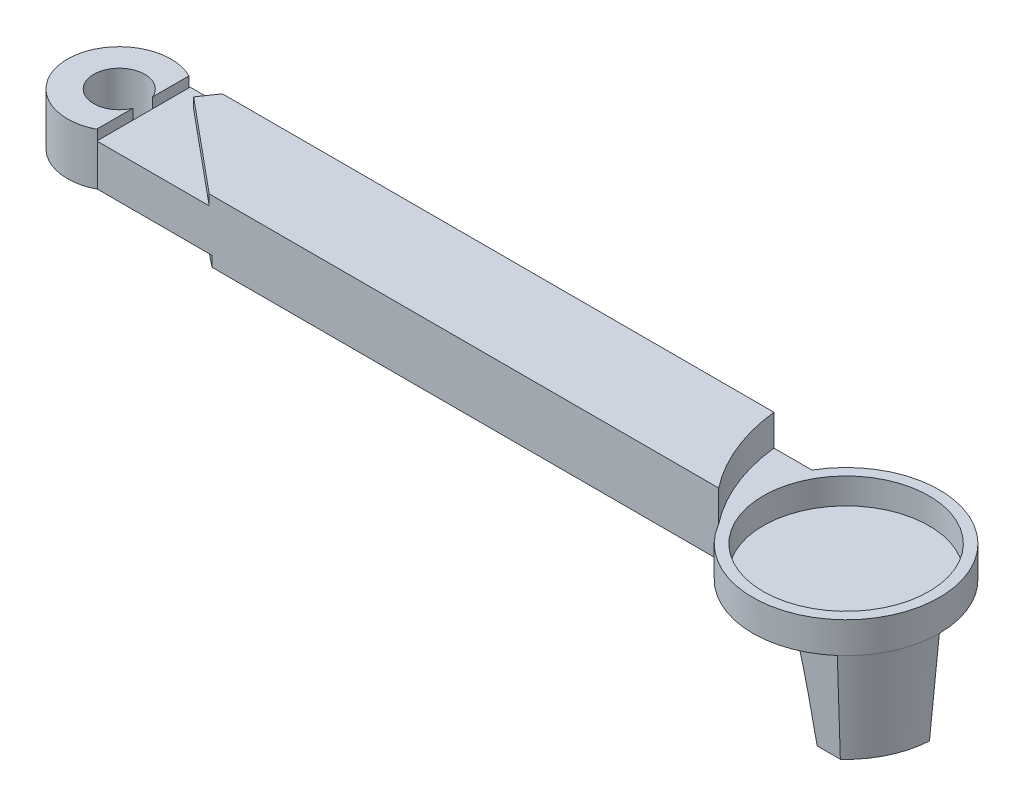
ISO-10303-21;
HEADER;
FILE_DESCRIPTION(('STEP AP214'),'2;1');
FILE_NAME('part.step','',(''),(''),'','','');
FILE_SCHEMA(('AUTOMOTIVE_DESIGN { 1 0 10303 214 1 1 1 1 }'));
ENDSEC;
DATA;
#1=APPLICATION_CONTEXT('core data for automotive mechanical design processes');
#2=APPLICATION_PROTOCOL_DEFINITION('international standard','automotive_design',2000,#1);
#3=PRODUCT_CONTEXT('',#1,'mechanical');
#4=PRODUCT('Part','Part','',(#3));
#5=PRODUCT_RELATED_PRODUCT_CATEGORY('part','',(#4));
#6=PRODUCT_DEFINITION_FORMATION('','',#4);
#7=PRODUCT_DEFINITION_CONTEXT('part definition',#1,'design');
#8=PRODUCT_DEFINITION('design','',#6,#7);
#9=PRODUCT_DEFINITION_SHAPE('','',#8);
#10=(LENGTH_UNIT() NAMED_UNIT(*) SI_UNIT(.MILLI.,.METRE.));
#11=(NAMED_UNIT(*) PLANE_ANGLE_UNIT() SI_UNIT($,.RADIAN.));
#12=(NAMED_UNIT(*) SI_UNIT($,.STERADIAN.) SOLID_ANGLE_UNIT());
#13=UNCERTAINTY_MEASURE_WITH_UNIT(LENGTH_MEASURE(1.E-05),#10,'distance_accuracy_value','');
#14=(GEOMETRIC_REPRESENTATION_CONTEXT(3) GLOBAL_UNCERTAINTY_ASSIGNED_CONTEXT((#13)) GLOBAL_UNIT_ASSIGNED_CONTEXT((#10,
#11,#12)) REPRESENTATION_CONTEXT('',''));
#15=CARTESIAN_POINT('',(0.,0.,0.));
#16=DIRECTION('',(0.,0.,1.));
#17=DIRECTION('',(1.,0.,0.));
#18=AXIS2_PLACEMENT_3D('',#15,#16,#17);
#19=CARTESIAN_POINT('',(0.,5.999999938,0.));
#20=DIRECTION('',(0.,0.,-1.));
#21=DIRECTION('',(-1.,0.,0.));
#22=AXIS2_PLACEMENT_3D('',#19,#20,#21);
#23=PLANE('',#22);
#24=DIRECTION('',(0.,1.,0.));
#25=VECTOR('',#24,1.);
#26=CARTESIAN_POINT('',(11.1059878060574,-116.582433247194,0.));
#27=LINE('',#26,#25);
#28=CARTESIAN_POINT('',(11.1059878060574,0.,0.));
#29=VERTEX_POINT('',#28);
#30=CARTESIAN_POINT('',(11.1059878060574,1.000000032,0.));
#31=VERTEX_POINT('',#30);
#32=EDGE_CURVE('E63',#29,#31,#27,.T.);
#33=ORIENTED_EDGE('',*,*,#32,.F.);
#34=DIRECTION('',(1.,0.,0.));
#35=VECTOR('',#34,1.);
#36=CARTESIAN_POINT('',(0.,0.,0.));
#37=LINE('',#36,#35);
#38=CARTESIAN_POINT('',(60.,0.,0.));
#39=VERTEX_POINT('',#38);
#40=EDGE_CURVE('E366',#29,#39,#37,.T.);
#41=ORIENTED_EDGE('',*,*,#40,.T.);
#42=DIRECTION('',(0.,-1.,0.));
#43=VECTOR('',#42,1.);
#44=CARTESIAN_POINT('',(60.,5.999999938,0.));
#45=LINE('',#44,#43);
#46=CARTESIAN_POINT('',(60.,2.999999938,0.));
#47=VERTEX_POINT('',#46);
#48=EDGE_CURVE('E51',#47,#39,#45,.T.);
#49=ORIENTED_EDGE('',*,*,#48,.F.);
#50=CARTESIAN_POINT('',(60.,5.999999938,0.));
#51=VERTEX_POINT('',#50);
#52=EDGE_CURVE('E11',#51,#47,#45,.T.);
#53=ORIENTED_EDGE('',*,*,#52,.F.);
#54=DIRECTION('',(1.,0.,0.));
#55=VECTOR('',#54,1.);
#56=CARTESIAN_POINT('',(0.,5.999999938,0.));
#57=LINE('',#56,#55);
#58=CARTESIAN_POINT('',(10.8365406297351,5.999999938,0.));
#59=VERTEX_POINT('',#58);
#60=EDGE_CURVE('E358',#59,#51,#57,.T.);
#61=ORIENTED_EDGE('',*,*,#60,.F.);
#62=DIRECTION('',(0.,1.,0.));
#63=VECTOR('',#62,1.);
#64=CARTESIAN_POINT('',(10.8365406297351,4.999999938,0.));
#65=LINE('',#64,#63);
#66=CARTESIAN_POINT('',(10.8365406297351,4.999999938,0.));
#67=VERTEX_POINT('',#66);
#68=EDGE_CURVE('E317',#67,#59,#65,.T.);
#69=ORIENTED_EDGE('',*,*,#68,.F.);
#70=DIRECTION('',(1.,0.,0.));
#71=VECTOR('',#70,1.);
#72=CARTESIAN_POINT('',(0.,4.999999938,0.));
#73=LINE('',#72,#71);
#74=CARTESIAN_POINT('',(0.0584310938736479,4.999999938,0.));
#75=VERTEX_POINT('',#74);
#76=EDGE_CURVE('E311',#75,#67,#73,.T.);
#77=ORIENTED_EDGE('',*,*,#76,.F.);
#78=DIRECTION('',(0.,1.,0.));
#79=VECTOR('',#78,1.);
#80=CARTESIAN_POINT('',(0.0584310938736479,0.,0.));
#81=LINE('',#80,#79);
#82=CARTESIAN_POINT('',(0.0584310938736479,1.000000032,0.));
#83=VERTEX_POINT('',#82);
#84=EDGE_CURVE('E189',#83,#75,#81,.T.);
#85=ORIENTED_EDGE('',*,*,#84,.F.);
#86=DIRECTION('',(1.,0.,0.));
#87=VECTOR('',#86,1.);
#88=CARTESIAN_POINT('',(0.,1.000000032,0.));
#89=LINE('',#88,#87);
#90=EDGE_CURVE('E58',#83,#31,#89,.T.);
#91=ORIENTED_EDGE('',*,*,#90,.T.);
#92=EDGE_LOOP('',(#33,#41,#49,#53,#61,#69,#77,#85,#91));
#93=FACE_BOUND('',#92,.T.);
#94=ADVANCED_FACE('F43',(#93),#23,.F.);
#95=CARTESIAN_POINT('',(0.,5.999999938,0.));
#96=DIRECTION('',(1.,0.,0.));
#97=DIRECTION('',(0.,0.,-1.));
#98=AXIS2_PLACEMENT_3D('',#95,#96,#97);
#99=PLANE('',#98);
#100=DIRECTION('',(0.,0.,-1.));
#101=VECTOR('',#100,1.);
#102=CARTESIAN_POINT('',(0.,1.000000032,0.));
#103=LINE('',#102,#101);
#104=CARTESIAN_POINT('',(0.,1.000000032,-3.47178534034408));
#105=VERTEX_POINT('',#104);
#106=CARTESIAN_POINT('',(0.,1.000000032,-5.38052297741591));
#107=VERTEX_POINT('',#106);
#108=EDGE_CURVE('E215',#105,#107,#103,.T.);
#109=ORIENTED_EDGE('',*,*,#108,.F.);
#110=DIRECTION('',(0.,1.,0.));
#111=VECTOR('',#110,1.);
#112=CARTESIAN_POINT('',(0.,0.,-3.47178534034408));
#113=LINE('',#112,#111);
#114=CARTESIAN_POINT('',(0.,4.999999938,-3.47178534034408));
#115=VERTEX_POINT('',#114);
#116=EDGE_CURVE('E339',#105,#115,#113,.T.);
#117=ORIENTED_EDGE('',*,*,#116,.T.);
#118=DIRECTION('',(0.,0.,1.));
#119=VECTOR('',#118,1.);
#120=CARTESIAN_POINT('',(0.,4.999999938,0.));
#121=LINE('',#120,#119);
#122=CARTESIAN_POINT('',(0.,4.999999938,-5.38052297741591));
#123=VERTEX_POINT('',#122);
#124=EDGE_CURVE('E413',#123,#115,#121,.T.);
#125=ORIENTED_EDGE('',*,*,#124,.F.);
#126=DIRECTION('',(0.,1.,0.));
#127=VECTOR('',#126,1.);
#128=CARTESIAN_POINT('',(0.,0.,-5.38052297741591));
#129=LINE('',#128,#127);
#130=EDGE_CURVE('E341',#123,#107,#129,.F.);
#131=ORIENTED_EDGE('',*,*,#130,.T.);
#132=EDGE_LOOP('',(#109,#117,#125,#131));
#133=FACE_BOUND('',#132,.T.);
#134=ADVANCED_FACE('F461',(#133),#99,.F.);
#135=CARTESIAN_POINT('',(-2.26732885973922,0.,-4.42615415887999));
#136=DIRECTION('',(0.,1.,0.));
#137=DIRECTION('',(0.,0.,1.));
#138=AXIS2_PLACEMENT_3D('',#135,#136,#137);
#139=CYLINDRICAL_SURFACE('',#138,2.46);
#140=ORIENTED_EDGE('',*,*,#116,.F.);
#141=CARTESIAN_POINT('',(-2.26732885973922,1.000000032,-4.42615415887999));
#142=DIRECTION('',(0.,-1.,0.));
#143=DIRECTION('',(0.,0.,-1.));
#144=AXIS2_PLACEMENT_3D('',#141,#142,#143);
#145=CIRCLE('',#144,2.46);
#146=EDGE_CURVE('E211',#105,#107,#145,.T.);
#147=ORIENTED_EDGE('',*,*,#146,.T.);
#148=ORIENTED_EDGE('',*,*,#130,.F.);
#149=CARTESIAN_POINT('',(0.,5.999999938,-5.38052297741591));
#150=VERTEX_POINT('',#149);
#151=EDGE_CURVE('E342',#150,#123,#129,.F.);
#152=ORIENTED_EDGE('',*,*,#151,.F.);
#153=CARTESIAN_POINT('',(-2.26732885973922,5.999999938,-4.42615415887999));
#154=DIRECTION('',(0.,1.,0.));
#155=DIRECTION('',(1.,0.,0.));
#156=AXIS2_PLACEMENT_3D('',#153,#154,#155);
#157=CIRCLE('',#156,2.46);
#158=CARTESIAN_POINT('',(0.,5.999999938,-3.47178534034408));
#159=VERTEX_POINT('',#158);
#160=EDGE_CURVE('E332',#159,#150,#157,.F.);
#161=ORIENTED_EDGE('',*,*,#160,.F.);
#162=DIRECTION('',(0.,1.,0.));
#163=VECTOR('',#162,1.);
#164=CARTESIAN_POINT('',(0.,0.,-3.47178534034408));
#165=LINE('',#164,#163);
#166=EDGE_CURVE('E329',#115,#159,#165,.T.);
#167=ORIENTED_EDGE('',*,*,#166,.F.);
#168=EDGE_LOOP('',(#140,#147,#148,#152,#161,#167));
#169=FACE_BOUND('',#168,.T.);
#170=ADVANCED_FACE('F466',(#169),#139,.F.);
#171=CARTESIAN_POINT('',(-2.26732885973922,0.,-4.42615415887999));
#172=DIRECTION('',(0.,1.,0.));
#173=DIRECTION('',(0.,0.,1.));
#174=AXIS2_PLACEMENT_3D('',#171,#172,#173);
#175=CYLINDRICAL_SURFACE('',#174,5.);
#176=CARTESIAN_POINT('',(-2.26732885973922,1.000000032,-4.42615415887999));
#177=DIRECTION('',(0.,-1.,0.));
#178=DIRECTION('',(0.,0.,-1.));
#179=AXIS2_PLACEMENT_3D('',#176,#177,#178);
#180=CIRCLE('',#179,5.);
#181=CARTESIAN_POINT('',(0.,1.000000032,-8.88252261781532));
#182=VERTEX_POINT('',#181);
#183=EDGE_CURVE('E184',#83,#182,#180,.T.);
#184=ORIENTED_EDGE('',*,*,#183,.F.);
#185=ORIENTED_EDGE('',*,*,#84,.T.);
#186=CARTESIAN_POINT('',(0.0584310938736479,5.999999938,0.));
#187=VERTEX_POINT('',#186);
#188=EDGE_CURVE('E337',#75,#187,#81,.T.);
#189=ORIENTED_EDGE('',*,*,#188,.T.);
#190=CARTESIAN_POINT('',(-2.26732885973922,5.999999938,-4.42615415887999));
#191=DIRECTION('',(0.,-1.,0.));
#192=DIRECTION('',(0.,0.,-1.));
#193=AXIS2_PLACEMENT_3D('',#190,#191,#192);
#194=CIRCLE('',#193,5.);
#195=CARTESIAN_POINT('',(0.,5.999999938,-8.88252261781532));
#196=VERTEX_POINT('',#195);
#197=EDGE_CURVE('E335',#187,#196,#194,.T.);
#198=ORIENTED_EDGE('',*,*,#197,.T.);
#199=DIRECTION('',(0.,1.,0.));
#200=VECTOR('',#199,1.);
#201=CARTESIAN_POINT('',(0.,0.,-8.88252261781532));
#202=LINE('',#201,#200);
#203=CARTESIAN_POINT('',(0.,4.999999938,-8.88252261781532));
#204=VERTEX_POINT('',#203);
#205=EDGE_CURVE('E186',#196,#204,#202,.F.);
#206=ORIENTED_EDGE('',*,*,#205,.T.);
#207=EDGE_CURVE('E180',#204,#182,#202,.F.);
#208=ORIENTED_EDGE('',*,*,#207,.T.);
#209=EDGE_LOOP('',(#184,#185,#189,#198,#206,#208));
#210=FACE_BOUND('',#209,.T.);
#211=ADVANCED_FACE('F182',(#210),#175,.T.);
#212=CARTESIAN_POINT('',(0.,5.999999938,-9.));
#213=DIRECTION('',(0.,0.,1.));
#214=DIRECTION('',(1.,0.,0.));
#215=AXIS2_PLACEMENT_3D('',#212,#213,#214);
#216=PLANE('',#215);
#217=DIRECTION('',(0.,-1.,0.));
#218=VECTOR('',#217,1.);
#219=CARTESIAN_POINT('',(3.11775190876774,114.970307966617,-9.));
#220=LINE('',#219,#218);
#221=CARTESIAN_POINT('',(3.11775190876774,5.999999938,-9.));
#222=VERTEX_POINT('',#221);
#223=CARTESIAN_POINT('',(3.11775190876774,4.999999938,-9.));
#224=VERTEX_POINT('',#223);
#225=EDGE_CURVE('E296',#222,#224,#220,.T.);
#226=ORIENTED_EDGE('',*,*,#225,.F.);
#227=DIRECTION('',(-1.,0.,0.));
#228=VECTOR('',#227,1.);
#229=CARTESIAN_POINT('',(0.,5.999999938,-9.));
#230=LINE('',#229,#228);
#231=CARTESIAN_POINT('',(56.3307889829448,5.999999938,-9.));
#232=VERTEX_POINT('',#231);
#233=EDGE_CURVE('E360',#232,#222,#230,.T.);
#234=ORIENTED_EDGE('',*,*,#233,.F.);
#235=DIRECTION('',(0.,-1.,0.));
#236=VECTOR('',#235,1.);
#237=CARTESIAN_POINT('',(56.3307889829448,108.629294651588,-9.));
#238=LINE('',#237,#236);
#239=CARTESIAN_POINT('',(56.3307889829448,2.999999938,-9.));
#240=VERTEX_POINT('',#239);
#241=EDGE_CURVE('E348',#232,#240,#238,.T.);
#242=ORIENTED_EDGE('',*,*,#241,.T.);
#243=DIRECTION('',(-1.,0.,0.));
#244=VECTOR('',#243,1.);
#245=CARTESIAN_POINT('',(0.,2.999999938,-9.));
#246=LINE('',#245,#244);
#247=CARTESIAN_POINT('',(60.,2.999999938,-9.));
#248=VERTEX_POINT('',#247);
#249=EDGE_CURVE('E344',#248,#240,#246,.T.);
#250=ORIENTED_EDGE('',*,*,#249,.F.);
#251=DIRECTION('',(0.,-1.,0.));
#252=VECTOR('',#251,1.);
#253=CARTESIAN_POINT('',(60.,5.999999938,-9.));
#254=LINE('',#253,#252);
#255=CARTESIAN_POINT('',(60.,0.,-9.));
#256=VERTEX_POINT('',#255);
#257=EDGE_CURVE('E374',#248,#256,#254,.T.);
#258=ORIENTED_EDGE('',*,*,#257,.T.);
#259=DIRECTION('',(-1.,0.,0.));
#260=VECTOR('',#259,1.);
#261=CARTESIAN_POINT('',(0.,0.,-9.));
#262=LINE('',#261,#260);
#263=CARTESIAN_POINT('',(0.,0.,-9.));
#264=VERTEX_POINT('',#263);
#265=EDGE_CURVE('E361',#256,#264,#262,.T.);
#266=ORIENTED_EDGE('',*,*,#265,.T.);
#267=DIRECTION('',(0.,-1.,0.));
#268=VECTOR('',#267,1.);
#269=CARTESIAN_POINT('',(0.,5.999999938,-9.));
#270=LINE('',#269,#268);
#271=CARTESIAN_POINT('',(0.,4.999999938,-9.));
#272=VERTEX_POINT('',#271);
#273=EDGE_CURVE('E364',#272,#264,#270,.T.);
#274=ORIENTED_EDGE('',*,*,#273,.F.);
#275=DIRECTION('',(-1.,0.,0.));
#276=VECTOR('',#275,1.);
#277=CARTESIAN_POINT('',(0.,4.999999938,-9.));
#278=LINE('',#277,#276);
#279=EDGE_CURVE('E245',#224,#272,#278,.T.);
#280=ORIENTED_EDGE('',*,*,#279,.F.);
#281=EDGE_LOOP('',(#226,#234,#242,#250,#258,#266,#274,#280));
#282=FACE_BOUND('',#281,.T.);
#283=ADVANCED_FACE('F401',(#282),#216,.F.);
#284=EDGE_CURVE('E315',#272,#204,#121,.T.);
#285=ORIENTED_EDGE('',*,*,#284,.F.);
#286=ORIENTED_EDGE('',*,*,#273,.T.);
#287=DIRECTION('',(0.,0.,1.));
#288=VECTOR('',#287,1.);
#289=CARTESIAN_POINT('',(0.,0.,0.));
#290=LINE('',#289,#288);
#291=CARTESIAN_POINT('',(0.,0.,-8.88252261781532));
#292=VERTEX_POINT('',#291);
#293=EDGE_CURVE('E195',#264,#292,#290,.T.);
#294=ORIENTED_EDGE('',*,*,#293,.T.);
#295=DIRECTION('',(0.,1.,0.));
#296=VECTOR('',#295,1.);
#297=CARTESIAN_POINT('',(0.,-116.582433247194,-8.88252261781532));
#298=LINE('',#297,#296);
#299=EDGE_CURVE('E193',#292,#182,#298,.T.);
#300=ORIENTED_EDGE('',*,*,#299,.T.);
#301=ORIENTED_EDGE('',*,*,#207,.F.);
#302=EDGE_LOOP('',(#285,#286,#294,#300,#301));
#303=FACE_BOUND('',#302,.T.);
#304=ADVANCED_FACE('F45',(#303),#99,.F.);
#305=CARTESIAN_POINT('',(67.7942286340599,5.999999938,-4.5));
#306=DIRECTION('',(0.,-1.,0.));
#307=DIRECTION('',(0.,0.,-1.));
#308=AXIS2_PLACEMENT_3D('',#305,#306,#307);
#309=PLANE('',#308);
#310=ORIENTED_EDGE('',*,*,#197,.F.);
#311=DIRECTION('',(1.,0.,0.));
#312=VECTOR('',#311,1.);
#313=CARTESIAN_POINT('',(0.,5.999999938,0.));
#314=LINE('',#313,#312);
#315=CARTESIAN_POINT('',(0.,5.999999938,0.));
#316=VERTEX_POINT('',#315);
#317=EDGE_CURVE('E305',#316,#187,#314,.T.);
#318=ORIENTED_EDGE('',*,*,#317,.F.);
#319=DIRECTION('',(0.,0.,1.));
#320=VECTOR('',#319,1.);
#321=CARTESIAN_POINT('',(0.,5.999999938,0.));
#322=LINE('',#321,#320);
#323=EDGE_CURVE('E323',#159,#316,#322,.T.);
#324=ORIENTED_EDGE('',*,*,#323,.F.);
#325=ORIENTED_EDGE('',*,*,#160,.T.);
#326=EDGE_CURVE('E325',#196,#150,#322,.T.);
#327=ORIENTED_EDGE('',*,*,#326,.F.);
#328=EDGE_LOOP('',(#310,#318,#324,#325,#327));
#329=FACE_BOUND('',#328,.T.);
#330=ADVANCED_FACE('F429',(#329),#309,.F.);
#331=ORIENTED_EDGE('',*,*,#233,.T.);
#332=DIRECTION('',(-0.567411434093972,0.,0.82343443239849));
#333=VECTOR('',#332,1.);
#334=CARTESIAN_POINT('',(1.9829290405798,5.999999938,-7.35313113520302));
#335=LINE('',#334,#333);
#336=CARTESIAN_POINT('',(1.9829290405798,5.999999938,-7.35313113520302));
#337=VERTEX_POINT('',#336);
#338=EDGE_CURVE('E297',#222,#337,#335,.T.);
#339=ORIENTED_EDGE('',*,*,#338,.T.);
#340=DIRECTION('',(-0.769283339281046,0.,-0.638907774177622));
#341=VECTOR('',#340,1.);
#342=CARTESIAN_POINT('',(0.,5.999999938,-9.));
#343=LINE('',#342,#341);
#344=EDGE_CURVE('E320',#59,#337,#343,.T.);
#345=ORIENTED_EDGE('',*,*,#344,.F.);
#346=ORIENTED_EDGE('',*,*,#60,.T.);
#347=CARTESIAN_POINT('',(74.0458842440092,5.999999938,-10.9743186618045));
#348=DIRECTION('',(0.,-1.,0.));
#349=DIRECTION('',(0.,0.,-1.));
#350=AXIS2_PLACEMENT_3D('',#347,#348,#349);
#351=CIRCLE('',#350,17.8247730500822);
#352=EDGE_CURVE('E349',#232,#51,#351,.F.);
#353=ORIENTED_EDGE('',*,*,#352,.F.);
#354=EDGE_LOOP('',(#331,#339,#345,#346,#353));
#355=FACE_BOUND('',#354,.T.);
#356=ADVANCED_FACE('F438',(#355),#309,.F.);
#357=CARTESIAN_POINT('',(67.7942286340599,5.999999938,-4.5));
#358=DIRECTION('',(0.,-1.,0.));
#359=DIRECTION('',(0.,0.,-1.));
#360=AXIS2_PLACEMENT_3D('',#357,#358,#359);
#361=CYLINDRICAL_SURFACE('',#360,9.);
#362=CARTESIAN_POINT('',(67.7942286340599,2.999999938,-4.5));
#363=DIRECTION('',(0.,1.,0.));
#364=DIRECTION('',(0.,0.,1.));
#365=AXIS2_PLACEMENT_3D('',#362,#363,#364);
#366=CIRCLE('',#365,9.);
#367=EDGE_CURVE('E353',#47,#248,#366,.T.);
#368=ORIENTED_EDGE('',*,*,#367,.F.);
#369=ORIENTED_EDGE('',*,*,#48,.T.);
#370=CARTESIAN_POINT('',(67.7942286340599,0.,-4.5));
#371=DIRECTION('',(0.,1.,0.));
#372=DIRECTION('',(0.,0.,-1.));
#373=AXIS2_PLACEMENT_3D('',#370,#371,#372);
#374=CIRCLE('',#373,9.);
#375=CARTESIAN_POINT('',(73.7207610970285,0.,2.27319813421839));
#376=VERTEX_POINT('',#375);
#377=EDGE_CURVE('E369',#39,#376,#374,.T.);
#378=ORIENTED_EDGE('',*,*,#377,.T.);
#379=CARTESIAN_POINT('',(67.7942286340599,0.,-4.50000000000004));
#380=DIRECTION('',(0.,-1.,0.));
#381=DIRECTION('',(0.,0.,1.));
#382=AXIS2_PLACEMENT_3D('',#379,#380,#381);
#383=CIRCLE('',#382,9.00000000000008);
#384=CARTESIAN_POINT('',(76.7942286340599,0.,-4.5));
#385=VERTEX_POINT('',#384);
#386=EDGE_CURVE('E221',#385,#376,#383,.T.);
#387=ORIENTED_EDGE('',*,*,#386,.F.);
#388=EDGE_CURVE('E368',#385,#256,#374,.T.);
#389=ORIENTED_EDGE('',*,*,#388,.T.);
#390=ORIENTED_EDGE('',*,*,#257,.F.);
#391=EDGE_LOOP('',(#368,#369,#378,#387,#389,#390));
#392=FACE_BOUND('',#391,.T.);
#393=ADVANCED_FACE('F383',(#392),#361,.T.);
#394=CARTESIAN_POINT('',(67.7942286340599,0.,-4.5));
#395=DIRECTION('',(0.,-1.,0.));
#396=DIRECTION('',(0.,0.,-1.));
#397=AXIS2_PLACEMENT_3D('',#394,#395,#396);
#398=PLANE('',#397);
#399=DIRECTION('',(0.780946585890828,0.,0.624597814585882));
#400=VECTOR('',#399,1.);
#401=CARTESIAN_POINT('',(0.,0.,-8.88252261781532));
#402=LINE('',#401,#400);
#403=EDGE_CURVE('E199',#292,#29,#402,.T.);
#404=ORIENTED_EDGE('',*,*,#403,.F.);
#405=ORIENTED_EDGE('',*,*,#293,.F.);
#406=ORIENTED_EDGE('',*,*,#265,.F.);
#407=ORIENTED_EDGE('',*,*,#388,.F.);
#408=DIRECTION('',(1.,0.,0.));
#409=VECTOR('',#408,1.);
#410=CARTESIAN_POINT('',(76.7942286340599,0.,-4.5));
#411=LINE('',#410,#409);
#412=CARTESIAN_POINT('',(72.7942286340599,0.,-4.5));
#413=VERTEX_POINT('',#412);
#414=EDGE_CURVE('E232',#413,#385,#411,.T.);
#415=ORIENTED_EDGE('',*,*,#414,.F.);
#416=CARTESIAN_POINT('',(67.2331495201895,0.,-2.93952421049937));
#417=DIRECTION('',(0.,1.,0.));
#418=DIRECTION('',(0.,0.,1.));
#419=AXIS2_PLACEMENT_3D('',#416,#417,#418);
#420=CIRCLE('',#419,5.77587098196829);
#421=CARTESIAN_POINT('',(69.7207610970285,0.,2.27319813421839));
#422=VERTEX_POINT('',#421);
#423=EDGE_CURVE('E229',#422,#413,#420,.T.);
#424=ORIENTED_EDGE('',*,*,#423,.F.);
#425=DIRECTION('',(-1.,0.,0.));
#426=VECTOR('',#425,1.);
#427=CARTESIAN_POINT('',(73.7207610970285,0.,2.27319813421839));
#428=LINE('',#427,#426);
#429=EDGE_CURVE('E226',#376,#422,#428,.T.);
#430=ORIENTED_EDGE('',*,*,#429,.F.);
#431=ORIENTED_EDGE('',*,*,#377,.F.);
#432=ORIENTED_EDGE('',*,*,#40,.F.);
#433=EDGE_LOOP('',(#404,#405,#406,#407,#415,#424,#430,#431,#432));
#434=FACE_BOUND('',#433,.T.);
#435=ADVANCED_FACE('F387',(#434),#398,.T.);
#436=CARTESIAN_POINT('',(67.7942286340599,2.999999938,-4.5));
#437=DIRECTION('',(0.,1.,0.));
#438=DIRECTION('',(0.,0.,1.));
#439=AXIS2_PLACEMENT_3D('',#436,#437,#438);
#440=PLANE('',#439);
#441=CARTESIAN_POINT('',(67.7942286340599,2.999999938,-4.5));
#442=DIRECTION('',(0.,1.,0.));
#443=DIRECTION('',(0.,0.,1.));
#444=AXIS2_PLACEMENT_3D('',#441,#442,#443);
#445=CIRCLE('',#444,8.);
#446=CARTESIAN_POINT('',(67.7942286340599,2.999999938,3.5));
#447=VERTEX_POINT('',#446);
#448=EDGE_CURVE('E217',#447,#447,#445,.T.);
#449=ORIENTED_EDGE('',*,*,#448,.F.);
#450=EDGE_LOOP('',(#449));
#451=FACE_BOUND('',#450,.T.);
#452=ORIENTED_EDGE('',*,*,#367,.T.);
#453=ORIENTED_EDGE('',*,*,#249,.T.);
#454=CARTESIAN_POINT('',(74.0458842440092,2.999999938,-10.9743186618045));
#455=DIRECTION('',(0.,-1.,0.));
#456=DIRECTION('',(0.,0.,-1.));
#457=AXIS2_PLACEMENT_3D('',#454,#455,#456);
#458=CIRCLE('',#457,17.8247730500822);
#459=EDGE_CURVE('E345',#240,#47,#458,.F.);
#460=ORIENTED_EDGE('',*,*,#459,.T.);
#461=EDGE_LOOP('',(#452,#453,#460));
#462=FACE_BOUND('',#461,.T.);
#463=ADVANCED_FACE('F446',(#451,#462),#440,.T.);
#464=CARTESIAN_POINT('',(74.0458842440092,108.629294651588,-10.9743186618045));
#465=DIRECTION('',(0.,-1.,0.));
#466=DIRECTION('',(0.,0.,-1.));
#467=AXIS2_PLACEMENT_3D('',#464,#465,#466);
#468=CYLINDRICAL_SURFACE('',#467,17.8247730500822);
#469=ORIENTED_EDGE('',*,*,#352,.T.);
#470=ORIENTED_EDGE('',*,*,#52,.T.);
#471=ORIENTED_EDGE('',*,*,#459,.F.);
#472=ORIENTED_EDGE('',*,*,#241,.F.);
#473=EDGE_LOOP('',(#469,#470,#471,#472));
#474=FACE_BOUND('',#473,.T.);
#475=ADVANCED_FACE('F444',(#474),#468,.F.);
#476=CARTESIAN_POINT('',(0.,4.999999938,0.));
#477=DIRECTION('',(0.,0.,1.));
#478=DIRECTION('',(1.,0.,0.));
#479=AXIS2_PLACEMENT_3D('',#476,#477,#478);
#480=PLANE('',#479);
#481=CARTESIAN_POINT('',(0.,4.999999938,0.));
#482=VERTEX_POINT('',#481);
#483=EDGE_CURVE('E307',#482,#75,#73,.T.);
#484=ORIENTED_EDGE('',*,*,#483,.F.);
#485=DIRECTION('',(0.,1.,0.));
#486=VECTOR('',#485,1.);
#487=CARTESIAN_POINT('',(0.,4.999999938,0.));
#488=LINE('',#487,#486);
#489=EDGE_CURVE('E326',#482,#316,#488,.T.);
#490=ORIENTED_EDGE('',*,*,#489,.T.);
#491=ORIENTED_EDGE('',*,*,#317,.T.);
#492=ORIENTED_EDGE('',*,*,#188,.F.);
#493=EDGE_LOOP('',(#484,#490,#491,#492));
#494=FACE_BOUND('',#493,.T.);
#495=ADVANCED_FACE('F425',(#494),#480,.F.);
#496=CARTESIAN_POINT('',(0.,4.999999938,0.));
#497=DIRECTION('',(-1.,0.,0.));
#498=DIRECTION('',(0.,0.,1.));
#499=AXIS2_PLACEMENT_3D('',#496,#497,#498);
#500=PLANE('',#499);
#501=ORIENTED_EDGE('',*,*,#166,.T.);
#502=ORIENTED_EDGE('',*,*,#323,.T.);
#503=ORIENTED_EDGE('',*,*,#489,.F.);
#504=EDGE_CURVE('E314',#115,#482,#121,.T.);
#505=ORIENTED_EDGE('',*,*,#504,.F.);
#506=EDGE_LOOP('',(#501,#502,#503,#505));
#507=FACE_BOUND('',#506,.T.);
#508=ADVANCED_FACE('F420',(#507),#500,.F.);
#509=ORIENTED_EDGE('',*,*,#151,.T.);
#510=EDGE_CURVE('E318',#204,#123,#121,.T.);
#511=ORIENTED_EDGE('',*,*,#510,.F.);
#512=ORIENTED_EDGE('',*,*,#205,.F.);
#513=ORIENTED_EDGE('',*,*,#326,.T.);
#514=EDGE_LOOP('',(#509,#511,#512,#513));
#515=FACE_BOUND('',#514,.T.);
#516=ADVANCED_FACE('F410',(#515),#500,.F.);
#517=CARTESIAN_POINT('',(0.,4.999999938,-9.));
#518=DIRECTION('',(0.638907774177622,0.,-0.769283339281046));
#519=DIRECTION('',(-0.769283339281046,0.,-0.638907774177622));
#520=AXIS2_PLACEMENT_3D('',#517,#518,#519);
#521=PLANE('',#520);
#522=ORIENTED_EDGE('',*,*,#344,.T.);
#523=DIRECTION('',(0.,-1.,0.));
#524=VECTOR('',#523,1.);
#525=CARTESIAN_POINT('',(1.9829290405798,114.970307966617,-7.35313113520302));
#526=LINE('',#525,#524);
#527=CARTESIAN_POINT('',(1.9829290405798,4.999999938,-7.35313113520302));
#528=VERTEX_POINT('',#527);
#529=EDGE_CURVE('E302',#337,#528,#526,.T.);
#530=ORIENTED_EDGE('',*,*,#529,.T.);
#531=DIRECTION('',(-0.769283339281046,0.,-0.638907774177622));
#532=VECTOR('',#531,1.);
#533=CARTESIAN_POINT('',(0.,4.999999938,-9.));
#534=LINE('',#533,#532);
#535=EDGE_CURVE('E310',#67,#528,#534,.T.);
#536=ORIENTED_EDGE('',*,*,#535,.F.);
#537=ORIENTED_EDGE('',*,*,#68,.T.);
#538=EDGE_LOOP('',(#522,#530,#536,#537));
#539=FACE_BOUND('',#538,.T.);
#540=ADVANCED_FACE('F434',(#539),#521,.F.);
#541=CARTESIAN_POINT('',(0.,4.999999938,0.));
#542=DIRECTION('',(0.,1.,0.));
#543=DIRECTION('',(0.,0.,1.));
#544=AXIS2_PLACEMENT_3D('',#541,#542,#543);
#545=PLANE('',#544);
#546=ORIENTED_EDGE('',*,*,#483,.T.);
#547=ORIENTED_EDGE('',*,*,#76,.T.);
#548=ORIENTED_EDGE('',*,*,#535,.T.);
#549=DIRECTION('',(-0.567411434093972,0.,0.82343443239849));
#550=VECTOR('',#549,1.);
#551=CARTESIAN_POINT('',(1.9829290405798,4.999999938,-7.35313113520302));
#552=LINE('',#551,#550);
#553=EDGE_CURVE('E294',#224,#528,#552,.T.);
#554=ORIENTED_EDGE('',*,*,#553,.F.);
#555=ORIENTED_EDGE('',*,*,#279,.T.);
#556=ORIENTED_EDGE('',*,*,#284,.T.);
#557=ORIENTED_EDGE('',*,*,#510,.T.);
#558=ORIENTED_EDGE('',*,*,#124,.T.);
#559=ORIENTED_EDGE('',*,*,#504,.T.);
#560=EDGE_LOOP('',(#546,#547,#548,#554,#555,#556,#557,#558,#559));
#561=FACE_BOUND('',#560,.T.);
#562=ADVANCED_FACE('F406',(#561),#545,.T.);
#563=CARTESIAN_POINT('',(1.9829290405798,114.970307966617,-7.35313113520302));
#564=DIRECTION('',(-0.823434432398489,0.,-0.567411434093972));
#565=DIRECTION('',(-0.567411434093972,0.,0.82343443239849));
#566=AXIS2_PLACEMENT_3D('',#563,#564,#565);
#567=PLANE('',#566);
#568=ORIENTED_EDGE('',*,*,#338,.F.);
#569=ORIENTED_EDGE('',*,*,#225,.T.);
#570=ORIENTED_EDGE('',*,*,#553,.T.);
#571=ORIENTED_EDGE('',*,*,#529,.F.);
#572=EDGE_LOOP('',(#568,#569,#570,#571));
#573=FACE_BOUND('',#572,.T.);
#574=ADVANCED_FACE('F260',(#573),#567,.T.);
#575=CARTESIAN_POINT('',(67.7942286340599,0.,-4.50000000000004));
#576=DIRECTION('',(0.,1.,0.));
#577=DIRECTION('',(0.,0.,1.));
#578=AXIS2_PLACEMENT_3D('',#575,#576,#577);
#579=CONICAL_SURFACE('',#578,9.00000000000008,0.05235987755983);
#580=ORIENTED_EDGE('',*,*,#386,.T.);
#581=CARTESIAN_POINT('',(73.5408063723507,-9.,1.80152812067102));
#582=CARTESIAN_POINT('',(73.5712609837328,-7.5000092145536,1.88013930668129));
#583=CARTESIAN_POINT('',(73.6014845164897,-6.00001382135271,1.95875073417374));
#584=CARTESIAN_POINT('',(73.6614694247151,-3.0000138213527,2.11597407202286));
#585=CARTESIAN_POINT('',(73.6912308001841,-1.50000921455359,2.19458598237954));
#586=CARTESIAN_POINT('',(73.7207610970285,0.,2.27319813421839));
#587=B_SPLINE_CURVE_WITH_KNOTS('',3,(#581,#582,#583,#584,#585,#586),.UNSPECIFIED.,.F.,.F.,(4,2,
4),(0.,4.507073838179,9.01414767061667),.UNSPECIFIED.);
#588=CARTESIAN_POINT('',(73.5408063723507,-9.,1.80152812067102));
#589=VERTEX_POINT('',#588);
#590=EDGE_CURVE('E236',#589,#376,#587,.T.);
#591=ORIENTED_EDGE('',*,*,#590,.F.);
#592=CARTESIAN_POINT('',(67.7942286340599,-9.,-4.50000000000004));
#593=DIRECTION('',(0.,1.,0.));
#594=DIRECTION('',(0.,0.,1.));
#595=AXIS2_PLACEMENT_3D('',#592,#593,#594);
#596=CIRCLE('',#595,8.5283299864527);
#597=CARTESIAN_POINT('',(76.3095054795974,-9.,-4.02832998645263));
#598=VERTEX_POINT('',#597);
#599=EDGE_CURVE('E235',#598,#589,#596,.F.);
#600=ORIENTED_EDGE('',*,*,#599,.F.);
#601=CARTESIAN_POINT('',(76.3095054795974,-9.,-4.02832998645263));
#602=CARTESIAN_POINT('',(76.3510450297888,-8.25006191409261,-4.06763257613481));
#603=CARTESIAN_POINT('',(76.3922821393126,-7.50010714173052,-4.10693604031703));
#604=CARTESIAN_POINT('',(76.4741756843993,-6.00016639135087,-4.18554460410056));
#605=CARTESIAN_POINT('',(76.5148321202821,-5.25018041335073,-4.22484970370097));
#606=CARTESIAN_POINT('',(76.5955885694979,-3.7501786238254,-4.30346146641058));
#607=CARTESIAN_POINT('',(76.6356885828538,-3.00016281230145,-4.34276812951972));
#608=CARTESIAN_POINT('',(76.7153540621046,-1.50010246143376,-4.42138296129923));
#609=CARTESIAN_POINT('',(76.7549195277052,-0.750057922074431,-4.46069112997043));
#610=CARTESIAN_POINT('',(76.7942286340599,0.,-4.5));
#611=B_SPLINE_CURVE_WITH_KNOTS('',3,(#601,#602,#603,#604,#605,#606,#607,#608,#609,#610),
.UNSPECIFIED.,.F.,.F.,(4,2,2,2,4),(0.,2.25634568244491,4.51269012246321,6.7690344699198,
9.02538005974249),.UNSPECIFIED.);
#612=EDGE_CURVE('E247',#598,#385,#611,.T.);
#613=ORIENTED_EDGE('',*,*,#612,.T.);
#614=EDGE_LOOP('',(#580,#591,#600,#613));
#615=FACE_BOUND('',#614,.T.);
#616=ADVANCED_FACE('F257',(#615),#579,.T.);
#617=CARTESIAN_POINT('',(73.7207610970285,0.,2.27319813421839));
#618=DIRECTION('',(0.,-0.0523359562429439,0.998629534754574));
#619=DIRECTION('',(0.,-0.998629534754574,-0.052335956242944));
#620=AXIS2_PLACEMENT_3D('',#617,#618,#619);
#621=PLANE('',#620);
#622=ORIENTED_EDGE('',*,*,#429,.T.);
#623=CARTESIAN_POINT('',(71.3018337403965,-9.,1.80152812067102));
#624=CARTESIAN_POINT('',(71.2484484554327,-8.62285930757351,1.82129322683836));
#625=CARTESIAN_POINT('',(71.1940441532687,-8.24586402954863,1.84105071215984));
#626=CARTESIAN_POINT('',(71.0829086072754,-7.49221366354278,1.88054785419805));
#627=CARTESIAN_POINT('',(71.026177349475,-7.1155585776182,1.90028751080702));
#628=CARTESIAN_POINT('',(70.8521098192797,-5.98650269529387,1.9594588222861));
#629=CARTESIAN_POINT('',(70.7308551456097,-5.23469235557633,1.99885953263272));
#630=CARTESIAN_POINT('',(70.538391474903,-4.1087318899291,2.05786862019779));
#631=CARTESIAN_POINT('',(70.4724685541299,-3.73367926468011,2.07752429540137));
#632=CARTESIAN_POINT('',(70.3363979986992,-2.98434720188401,2.11679512475809));
#633=CARTESIAN_POINT('',(70.2662504870577,-2.61006774215097,2.13641028007396));
#634=CARTESIAN_POINT('',(70.1207978899309,-1.86234326398456,2.17559685949023));
#635=CARTESIAN_POINT('',(70.0454907088571,-1.48889864897234,2.19516826244823));
#636=CARTESIAN_POINT('',(69.9276971653644,-0.929727866974462,2.2244731613727));
#637=CARTESIAN_POINT('',(69.8876250406743,-0.743494239082589,2.23423325223834));
#638=CARTESIAN_POINT('',(69.8056354780345,-0.371428223733543,2.25373240584947));
#639=CARTESIAN_POINT('',(69.7637179956862,-0.185595846043257,2.26347146808311));
#640=CARTESIAN_POINT('',(69.7207610970285,0.,2.27319813421839));
#641=B_SPLINE_CURVE_WITH_KNOTS('',3,(#623,#624,#625,#626,#627,#628,#629,#630,#631,#632,#633,
#634,#635,#636,#637,#638,#639,#640),.UNSPECIFIED.,.F.,.F.,(4,2,2,2,2,2,2,2,4),(0.,
1.144233021625,2.28847291423586,4.57598537432994,5.71989433364963,6.86376999948108,
8.00811303384916,8.58034241693997,9.15258557517242),.UNSPECIFIED.);
#642=CARTESIAN_POINT('',(71.3018337403965,-9.,1.80152812067102));
#643=VERTEX_POINT('',#642);
#644=EDGE_CURVE('E246',#643,#422,#641,.T.);
#645=ORIENTED_EDGE('',*,*,#644,.F.);
#646=DIRECTION('',(1.,0.,0.));
#647=VECTOR('',#646,1.);
#648=CARTESIAN_POINT('',(67.7942286340599,-9.,1.80152812067102));
#649=LINE('',#648,#647);
#650=EDGE_CURVE('E288',#589,#643,#649,.F.);
#651=ORIENTED_EDGE('',*,*,#650,.F.);
#652=ORIENTED_EDGE('',*,*,#590,.T.);
#653=EDGE_LOOP('',(#622,#645,#651,#652));
#654=FACE_BOUND('',#653,.T.);
#655=ADVANCED_FACE('F254',(#654),#621,.T.);
#656=CARTESIAN_POINT('',(67.2331495201895,0.,-2.93952421049937));
#657=DIRECTION('',(0.,-1.,0.));
#658=DIRECTION('',(0.,0.,1.));
#659=AXIS2_PLACEMENT_3D('',#656,#657,#658);
#660=CONICAL_SURFACE('',#659,5.77587098196829,0.05235987755983);
#661=ORIENTED_EDGE('',*,*,#423,.T.);
#662=CARTESIAN_POINT('',(73.3850817754163,-9.,-4.02832998645263));
#663=CARTESIAN_POINT('',(73.3381973932151,-8.2498474393994,-4.06764381627719));
#664=CARTESIAN_POINT('',(73.2907822618413,-7.49972783254977,-4.10695591906885));
#665=CARTESIAN_POINT('',(73.1948063945251,-5.99956377266622,-4.18557618600758));
#666=CARTESIAN_POINT('',(73.1462456616874,-5.24951931943417,-4.22488435016503));
#667=CARTESIAN_POINT('',(73.0478942165764,-3.74951051168782,-4.30349648068402));
#668=CARTESIAN_POINT('',(72.9981035039164,-2.99954615719879,-4.34280044704423));
#669=CARTESIAN_POINT('',(72.89719029682,-1.49970479689832,-4.42140380201444));
#670=CARTESIAN_POINT('',(72.8460677987742,-0.749827791329128,-4.46070319061173));
#671=CARTESIAN_POINT('',(72.7942286340599,0.,-4.5));
#672=B_SPLINE_CURVE_WITH_KNOTS('',3,(#662,#663,#664,#665,#666,#667,#668,#669,#670,#671),
.UNSPECIFIED.,.F.,.F.,(4,2,2,2,4),(0.,2.25793118850051,4.51585625861958,6.77378203896768,
9.03171393932441),.UNSPECIFIED.);
#673=CARTESIAN_POINT('',(73.3850817754163,-9.,-4.02832998645263));
#674=VERTEX_POINT('',#673);
#675=EDGE_CURVE('E273',#674,#413,#672,.T.);
#676=ORIENTED_EDGE('',*,*,#675,.F.);
#677=CARTESIAN_POINT('',(67.2331495201895,-9.,-2.93952421049937));
#678=DIRECTION('',(0.,1.,0.));
#679=DIRECTION('',(0.,0.,1.));
#680=AXIS2_PLACEMENT_3D('',#677,#678,#679);
#681=CIRCLE('',#680,6.24754099551566);
#682=EDGE_CURVE('E290',#643,#674,#681,.T.);
#683=ORIENTED_EDGE('',*,*,#682,.F.);
#684=ORIENTED_EDGE('',*,*,#644,.T.);
#685=EDGE_LOOP('',(#661,#676,#683,#684));
#686=FACE_BOUND('',#685,.T.);
#687=ADVANCED_FACE('F268',(#686),#660,.F.);
#688=CARTESIAN_POINT('',(76.7942286340599,0.,-4.5));
#689=DIRECTION('',(0.,-0.0523359562429439,-0.998629534754574));
#690=DIRECTION('',(0.,0.998629534754574,-0.052335956242944));
#691=AXIS2_PLACEMENT_3D('',#688,#689,#690);
#692=PLANE('',#691);
#693=ORIENTED_EDGE('',*,*,#414,.T.);
#694=ORIENTED_EDGE('',*,*,#612,.F.);
#695=DIRECTION('',(-1.,0.,0.));
#696=VECTOR('',#695,1.);
#697=CARTESIAN_POINT('',(67.7942286340599,-9.,-4.02832998645263));
#698=LINE('',#697,#696);
#699=EDGE_CURVE('E292',#674,#598,#698,.F.);
#700=ORIENTED_EDGE('',*,*,#699,.F.);
#701=ORIENTED_EDGE('',*,*,#675,.T.);
#702=EDGE_LOOP('',(#693,#694,#700,#701));
#703=FACE_BOUND('',#702,.T.);
#704=ADVANCED_FACE('F262',(#703),#692,.T.);
#705=CARTESIAN_POINT('',(67.7942286340599,-9.,-4.50000000000004));
#706=DIRECTION('',(0.,1.,0.));
#707=DIRECTION('',(0.,0.,1.));
#708=AXIS2_PLACEMENT_3D('',#705,#706,#707);
#709=PLANE('',#708);
#710=ORIENTED_EDGE('',*,*,#599,.T.);
#711=ORIENTED_EDGE('',*,*,#650,.T.);
#712=ORIENTED_EDGE('',*,*,#682,.T.);
#713=ORIENTED_EDGE('',*,*,#699,.T.);
#714=EDGE_LOOP('',(#710,#711,#712,#713));
#715=FACE_BOUND('',#714,.T.);
#716=ADVANCED_FACE('F267',(#715),#709,.F.);
#717=CARTESIAN_POINT('',(67.7942286340599,0.499999937999999,-4.5));
#718=DIRECTION('',(0.,1.,0.));
#719=DIRECTION('',(0.,0.,1.));
#720=AXIS2_PLACEMENT_3D('',#717,#718,#719);
#721=CYLINDRICAL_SURFACE('',#720,8.);
#722=CARTESIAN_POINT('',(67.7942286340599,0.499999937999999,-4.5));
#723=DIRECTION('',(0.,1.,0.));
#724=DIRECTION('',(0.,0.,1.));
#725=AXIS2_PLACEMENT_3D('',#722,#723,#724);
#726=CIRCLE('',#725,8.);
#727=CARTESIAN_POINT('',(67.7942286340599,0.499999937999999,3.5));
#728=VERTEX_POINT('',#727);
#729=EDGE_CURVE('E218',#728,#728,#726,.T.);
#730=ORIENTED_EDGE('',*,*,#729,.F.);
#731=EDGE_LOOP('',(#730));
#732=FACE_BOUND('',#731,.T.);
#733=ORIENTED_EDGE('',*,*,#448,.T.);
#734=EDGE_LOOP('',(#733));
#735=FACE_BOUND('',#734,.T.);
#736=ADVANCED_FACE('F541',(#732,#735),#721,.F.);
#737=CARTESIAN_POINT('',(67.7942286340599,0.499999937999999,-4.5));
#738=DIRECTION('',(0.,1.,0.));
#739=DIRECTION('',(0.,0.,1.));
#740=AXIS2_PLACEMENT_3D('',#737,#738,#739);
#741=PLANE('',#740);
#742=ORIENTED_EDGE('',*,*,#729,.T.);
#743=EDGE_LOOP('',(#742));
#744=FACE_BOUND('',#743,.T.);
#745=ADVANCED_FACE('F502',(#744),#741,.T.);
#746=CARTESIAN_POINT('',(67.7942286340599,1.000000032,-4.5));
#747=DIRECTION('',(0.,-1.,0.));
#748=DIRECTION('',(0.,0.,-1.));
#749=AXIS2_PLACEMENT_3D('',#746,#747,#748);
#750=PLANE('',#749);
#751=DIRECTION('',(0.780946585890828,0.,0.624597814585882));
#752=VECTOR('',#751,1.);
#753=CARTESIAN_POINT('',(0.,1.000000032,-8.88252261781532));
#754=LINE('',#753,#752);
#755=EDGE_CURVE('E204',#182,#31,#754,.T.);
#756=ORIENTED_EDGE('',*,*,#755,.T.);
#757=ORIENTED_EDGE('',*,*,#90,.F.);
#758=ORIENTED_EDGE('',*,*,#183,.T.);
#759=EDGE_LOOP('',(#756,#757,#758));
#760=FACE_BOUND('',#759,.T.);
#761=ORIENTED_EDGE('',*,*,#146,.F.);
#762=ORIENTED_EDGE('',*,*,#108,.T.);
#763=EDGE_LOOP('',(#761,#762));
#764=FACE_BOUND('',#763,.T.);
#765=ADVANCED_FACE('F202',(#760,#764),#750,.T.);
#766=CARTESIAN_POINT('',(0.,-116.582433247194,-8.88252261781532));
#767=DIRECTION('',(-0.624597814585882,0.,0.780946585890828));
#768=DIRECTION('',(0.780946585890828,0.,0.624597814585882));
#769=AXIS2_PLACEMENT_3D('',#766,#767,#768);
#770=PLANE('',#769);
#771=ORIENTED_EDGE('',*,*,#299,.F.);
#772=ORIENTED_EDGE('',*,*,#403,.T.);
#773=ORIENTED_EDGE('',*,*,#32,.T.);
#774=ORIENTED_EDGE('',*,*,#755,.F.);
#775=EDGE_LOOP('',(#771,#772,#773,#774));
#776=FACE_BOUND('',#775,.T.);
#777=ADVANCED_FACE('F206',(#776),#770,.T.);
#778=CLOSED_SHELL('',(#94,#134,#170,#211,#283,#304,#330,#356,#393,#435,#463,#475,#495,#508,#516,
#540,#562,#574,#616,#655,#687,#704,#716,#736,#745,#765,#777));
#779=MANIFOLD_SOLID_BREP('B2',#778);
#780=ADVANCED_BREP_SHAPE_REPRESENTATION('',(#18,#779),#14);
#781=SHAPE_DEFINITION_REPRESENTATION(#9,#780);
ENDSEC;
END-ISO-10303-21;
